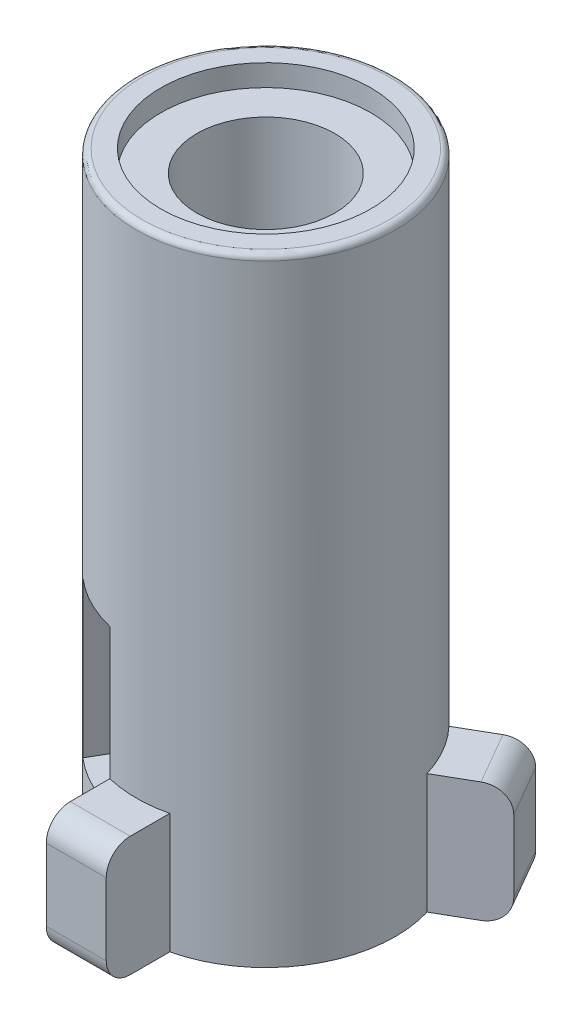
ISO-10303-21;
HEADER;
FILE_DESCRIPTION(('STEP AP214'),'2;1');
FILE_NAME('part.step','',(''),(''),'','','');
FILE_SCHEMA(('AUTOMOTIVE_DESIGN { 1 0 10303 214 1 1 1 1 }'));
ENDSEC;
DATA;
#1=APPLICATION_CONTEXT('core data for automotive mechanical design processes');
#2=APPLICATION_PROTOCOL_DEFINITION('international standard','automotive_design',2000,#1);
#3=PRODUCT_CONTEXT('',#1,'mechanical');
#4=PRODUCT('Part','Part','',(#3));
#5=PRODUCT_RELATED_PRODUCT_CATEGORY('part','',(#4));
#6=PRODUCT_DEFINITION_FORMATION('','',#4);
#7=PRODUCT_DEFINITION_CONTEXT('part definition',#1,'design');
#8=PRODUCT_DEFINITION('design','',#6,#7);
#9=PRODUCT_DEFINITION_SHAPE('','',#8);
#10=(LENGTH_UNIT() NAMED_UNIT(*) SI_UNIT(.MILLI.,.METRE.));
#11=(NAMED_UNIT(*) PLANE_ANGLE_UNIT() SI_UNIT($,.RADIAN.));
#12=(NAMED_UNIT(*) SI_UNIT($,.STERADIAN.) SOLID_ANGLE_UNIT());
#13=UNCERTAINTY_MEASURE_WITH_UNIT(LENGTH_MEASURE(1.E-05),#10,'distance_accuracy_value','');
#14=(GEOMETRIC_REPRESENTATION_CONTEXT(3) GLOBAL_UNCERTAINTY_ASSIGNED_CONTEXT((#13)) GLOBAL_UNIT_ASSIGNED_CONTEXT((#10,
#11,#12)) REPRESENTATION_CONTEXT('',''));
#15=CARTESIAN_POINT('',(0.,0.,0.));
#16=DIRECTION('',(0.,0.,1.));
#17=DIRECTION('',(1.,0.,0.));
#18=AXIS2_PLACEMENT_3D('',#15,#16,#17);
#19=CARTESIAN_POINT('',(0.,25.75,0.));
#20=DIRECTION('',(0.,-1.,0.));
#21=DIRECTION('',(0.,0.,-1.));
#22=AXIS2_PLACEMENT_3D('',#19,#20,#21);
#23=CYLINDRICAL_SURFACE('',#22,2.875);
#24=CARTESIAN_POINT('',(0.,24.85,0.));
#25=DIRECTION('',(0.,1.,0.));
#26=DIRECTION('',(0.,0.,1.));
#27=AXIS2_PLACEMENT_3D('',#24,#25,#26);
#28=CIRCLE('',#27,2.875);
#29=CARTESIAN_POINT('',(0.,24.85,2.875));
#30=VERTEX_POINT('',#29);
#31=EDGE_CURVE('E237',#30,#30,#28,.F.);
#32=ORIENTED_EDGE('',*,*,#31,.F.);
#33=EDGE_LOOP('',(#32));
#34=FACE_BOUND('',#33,.T.);
#35=CARTESIAN_POINT('',(0.,0.900000000000001,0.));
#36=DIRECTION('',(0.,-1.,0.));
#37=DIRECTION('',(0.,0.,-1.));
#38=AXIS2_PLACEMENT_3D('',#35,#36,#37);
#39=CIRCLE('',#38,2.875);
#40=CARTESIAN_POINT('',(0.,0.900000000000001,-2.875));
#41=VERTEX_POINT('',#40);
#42=EDGE_CURVE('E245',#41,#41,#39,.F.);
#43=ORIENTED_EDGE('',*,*,#42,.F.);
#44=EDGE_LOOP('',(#43));
#45=FACE_BOUND('',#44,.T.);
#46=DIRECTION('',(0.,-1.,0.));
#47=VECTOR('',#46,1.);
#48=CARTESIAN_POINT('',(0.124692696621201,25.75,2.87229468046183));
#49=LINE('',#48,#47);
#50=CARTESIAN_POINT('',(0.124692696621201,10.5,2.87229468046183));
#51=VERTEX_POINT('',#50);
#52=CARTESIAN_POINT('',(0.124692696621201,4.,2.87229468046183));
#53=VERTEX_POINT('',#52);
#54=EDGE_CURVE('E223',#51,#53,#49,.T.);
#55=ORIENTED_EDGE('',*,*,#54,.F.);
#56=CARTESIAN_POINT('',(0.,10.5,0.));
#57=DIRECTION('',(0.,-1.,0.));
#58=DIRECTION('',(0.,0.,-1.));
#59=AXIS2_PLACEMENT_3D('',#56,#57,#58);
#60=CIRCLE('',#59,2.875);
#61=CARTESIAN_POINT('',(-2.25145289354456,10.5,1.78789956880967));
#62=VERTEX_POINT('',#61);
#63=EDGE_CURVE('E229',#62,#51,#60,.F.);
#64=ORIENTED_EDGE('',*,*,#63,.F.);
#65=DIRECTION('',(0.,-1.,0.));
#66=VECTOR('',#65,1.);
#67=CARTESIAN_POINT('',(-2.25145289354457,25.75,1.78789956880967));
#68=LINE('',#67,#66);
#69=CARTESIAN_POINT('',(-2.25145289354457,4.,1.78789956880967));
#70=VERTEX_POINT('',#69);
#71=EDGE_CURVE('E226',#70,#62,#68,.F.);
#72=ORIENTED_EDGE('',*,*,#71,.F.);
#73=CARTESIAN_POINT('',(0.,4.,0.));
#74=DIRECTION('',(0.,1.,0.));
#75=DIRECTION('',(-1.,0.,0.));
#76=AXIS2_PLACEMENT_3D('',#73,#74,#75);
#77=CIRCLE('',#76,2.875);
#78=EDGE_CURVE('E201',#53,#70,#77,.F.);
#79=ORIENTED_EDGE('',*,*,#78,.F.);
#80=EDGE_LOOP('',(#55,#64,#72,#79));
#81=FACE_BOUND('',#80,.T.);
#82=ADVANCED_FACE('F39',(#34,#45,#81),#23,.F.);
#83=CARTESIAN_POINT('',(0.,25.75,0.));
#84=DIRECTION('',(0.,-1.,0.));
#85=DIRECTION('',(0.,0.,-1.));
#86=AXIS2_PLACEMENT_3D('',#83,#84,#85);
#87=CYLINDRICAL_SURFACE('',#86,5.4);
#88=CARTESIAN_POINT('',(0.,25.5,0.));
#89=DIRECTION('',(0.,1.,0.));
#90=DIRECTION('',(0.,0.,1.));
#91=AXIS2_PLACEMENT_3D('',#88,#89,#90);
#92=CIRCLE('',#91,5.4);
#93=CARTESIAN_POINT('',(0.,25.5,5.4));
#94=VERTEX_POINT('',#93);
#95=EDGE_CURVE('E196',#94,#94,#92,.F.);
#96=ORIENTED_EDGE('',*,*,#95,.T.);
#97=EDGE_LOOP('',(#96));
#98=FACE_BOUND('',#97,.T.);
#99=DIRECTION('',(0.,-1.,0.));
#100=VECTOR('',#99,1.);
#101=CARTESIAN_POINT('',(-1.25,25.75,5.25333227580362));
#102=LINE('',#101,#100);
#103=CARTESIAN_POINT('',(-1.25,5.,5.25333227580362));
#104=VERTEX_POINT('',#103);
#105=CARTESIAN_POINT('',(-1.25,10.5,5.25333227580362));
#106=VERTEX_POINT('',#105);
#107=EDGE_CURVE('E215',#104,#106,#102,.F.);
#108=ORIENTED_EDGE('',*,*,#107,.F.);
#109=CARTESIAN_POINT('',(0.,5.,0.));
#110=DIRECTION('',(0.,-1.,0.));
#111=DIRECTION('',(0.,0.,-1.));
#112=AXIS2_PLACEMENT_3D('',#109,#110,#111);
#113=CIRCLE('',#112,5.4);
#114=CARTESIAN_POINT('',(1.25,5.,5.25333227580362));
#115=VERTEX_POINT('',#114);
#116=EDGE_CURVE('E345',#115,#104,#113,.T.);
#117=ORIENTED_EDGE('',*,*,#116,.F.);
#118=DIRECTION('',(0.,-1.,0.));
#119=VECTOR('',#118,1.);
#120=CARTESIAN_POINT('',(1.25,25.75,5.25333227580362));
#121=LINE('',#120,#119);
#122=CARTESIAN_POINT('',(1.25,0.,5.25333227580362));
#123=VERTEX_POINT('',#122);
#124=EDGE_CURVE('E330',#115,#123,#121,.T.);
#125=ORIENTED_EDGE('',*,*,#124,.T.);
#126=CARTESIAN_POINT('',(0.,0.,0.));
#127=DIRECTION('',(0.,1.,0.));
#128=DIRECTION('',(0.,0.,1.));
#129=AXIS2_PLACEMENT_3D('',#126,#127,#128);
#130=CIRCLE('',#129,5.4);
#131=CARTESIAN_POINT('',(5.17451920536665,0.,-1.54413438317126));
#132=VERTEX_POINT('',#131);
#133=EDGE_CURVE('E341',#123,#132,#130,.T.);
#134=ORIENTED_EDGE('',*,*,#133,.T.);
#135=DIRECTION('',(0.,-1.,0.));
#136=VECTOR('',#135,1.);
#137=CARTESIAN_POINT('',(5.17451920536665,25.75,-1.54413438317126));
#138=LINE('',#137,#136);
#139=CARTESIAN_POINT('',(5.17451920536665,5.,-1.54413438317126));
#140=VERTEX_POINT('',#139);
#141=EDGE_CURVE('E306',#132,#140,#138,.F.);
#142=ORIENTED_EDGE('',*,*,#141,.T.);
#143=CARTESIAN_POINT('',(0.,5.,0.));
#144=DIRECTION('',(0.,1.,0.));
#145=DIRECTION('',(0.,0.,1.));
#146=AXIS2_PLACEMENT_3D('',#143,#144,#145);
#147=CIRCLE('',#146,5.4);
#148=CARTESIAN_POINT('',(3.92451920536665,5.,-3.70919789263236));
#149=VERTEX_POINT('',#148);
#150=EDGE_CURVE('E350',#140,#149,#147,.T.);
#151=ORIENTED_EDGE('',*,*,#150,.T.);
#152=DIRECTION('',(0.,-1.,0.));
#153=VECTOR('',#152,1.);
#154=CARTESIAN_POINT('',(3.92451920536665,25.75,-3.70919789263236));
#155=LINE('',#154,#153);
#156=CARTESIAN_POINT('',(3.92451920536665,0.,-3.70919789263236));
#157=VERTEX_POINT('',#156);
#158=EDGE_CURVE('E299',#149,#157,#155,.T.);
#159=ORIENTED_EDGE('',*,*,#158,.T.);
#160=CARTESIAN_POINT('',(-3.92451920536665,0.,-3.70919789263236));
#161=VERTEX_POINT('',#160);
#162=EDGE_CURVE('E346',#157,#161,#130,.T.);
#163=ORIENTED_EDGE('',*,*,#162,.T.);
#164=DIRECTION('',(0.,-1.,0.));
#165=VECTOR('',#164,1.);
#166=CARTESIAN_POINT('',(-3.92451920536665,25.75,-3.70919789263236));
#167=LINE('',#166,#165);
#168=CARTESIAN_POINT('',(-3.92451920536665,5.,-3.70919789263236));
#169=VERTEX_POINT('',#168);
#170=EDGE_CURVE('E269',#161,#169,#167,.F.);
#171=ORIENTED_EDGE('',*,*,#170,.T.);
#172=CARTESIAN_POINT('',(0.,5.,0.));
#173=DIRECTION('',(0.,1.,0.));
#174=DIRECTION('',(0.,0.,1.));
#175=AXIS2_PLACEMENT_3D('',#172,#173,#174);
#176=CIRCLE('',#175,5.4);
#177=CARTESIAN_POINT('',(-5.17451920536665,5.,-1.54413438317126));
#178=VERTEX_POINT('',#177);
#179=EDGE_CURVE('E353',#169,#178,#176,.T.);
#180=ORIENTED_EDGE('',*,*,#179,.T.);
#181=DIRECTION('',(0.,-1.,0.));
#182=VECTOR('',#181,1.);
#183=CARTESIAN_POINT('',(-5.17451920536665,25.75,-1.54413438317126));
#184=LINE('',#183,#182);
#185=CARTESIAN_POINT('',(-5.17451920536665,0.,-1.54413438317126));
#186=VERTEX_POINT('',#185);
#187=EDGE_CURVE('E276',#178,#186,#184,.T.);
#188=ORIENTED_EDGE('',*,*,#187,.T.);
#189=CARTESIAN_POINT('',(-1.25,0.,5.25333227580362));
#190=VERTEX_POINT('',#189);
#191=EDGE_CURVE('E340',#186,#190,#130,.T.);
#192=ORIENTED_EDGE('',*,*,#191,.T.);
#193=DIRECTION('',(0.,-1.,0.));
#194=VECTOR('',#193,1.);
#195=CARTESIAN_POINT('',(-1.25,25.75,5.25333227580362));
#196=LINE('',#195,#194);
#197=CARTESIAN_POINT('',(-1.25,4.,5.25333227580362));
#198=VERTEX_POINT('',#197);
#199=EDGE_CURVE('E209',#190,#198,#196,.F.);
#200=ORIENTED_EDGE('',*,*,#199,.T.);
#201=CARTESIAN_POINT('',(0.,4.,0.));
#202=DIRECTION('',(0.,1.,0.));
#203=DIRECTION('',(-1.,0.,0.));
#204=AXIS2_PLACEMENT_3D('',#201,#202,#203);
#205=CIRCLE('',#204,5.4);
#206=CARTESIAN_POINT('',(-3.56228993209276,4.,4.05833592001827));
#207=VERTEX_POINT('',#206);
#208=EDGE_CURVE('E198',#207,#198,#205,.T.);
#209=ORIENTED_EDGE('',*,*,#208,.F.);
#210=DIRECTION('',(0.,-1.,0.));
#211=VECTOR('',#210,1.);
#212=CARTESIAN_POINT('',(-3.56228993209276,25.75,4.05833592001827));
#213=LINE('',#212,#211);
#214=CARTESIAN_POINT('',(-3.56228993209276,10.5,4.05833592001827));
#215=VERTEX_POINT('',#214);
#216=EDGE_CURVE('E48',#215,#207,#213,.T.);
#217=ORIENTED_EDGE('',*,*,#216,.F.);
#218=CARTESIAN_POINT('',(0.,10.5,0.));
#219=DIRECTION('',(0.,-1.,0.));
#220=DIRECTION('',(0.,0.,-1.));
#221=AXIS2_PLACEMENT_3D('',#218,#219,#220);
#222=CIRCLE('',#221,5.4);
#223=EDGE_CURVE('E11',#106,#215,#222,.T.);
#224=ORIENTED_EDGE('',*,*,#223,.F.);
#225=EDGE_LOOP('',(#108,#117,#125,#134,#142,#151,#159,#163,#171,#180,#188,#192,#200,#209,#217,#224));
#226=FACE_BOUND('',#225,.T.);
#227=ADVANCED_FACE('F206',(#98,#226),#87,.T.);
#228=CARTESIAN_POINT('',(0.,25.75,0.));
#229=DIRECTION('',(0.,1.,0.));
#230=DIRECTION('',(0.,0.,1.));
#231=AXIS2_PLACEMENT_3D('',#228,#229,#230);
#232=PLANE('',#231);
#233=CARTESIAN_POINT('',(0.,25.75,0.));
#234=DIRECTION('',(0.,1.,0.));
#235=DIRECTION('',(0.,0.,1.));
#236=AXIS2_PLACEMENT_3D('',#233,#234,#235);
#237=CIRCLE('',#236,4.375);
#238=CARTESIAN_POINT('',(0.,25.75,4.375));
#239=VERTEX_POINT('',#238);
#240=EDGE_CURVE('E232',#239,#239,#237,.T.);
#241=ORIENTED_EDGE('',*,*,#240,.F.);
#242=EDGE_LOOP('',(#241));
#243=FACE_BOUND('',#242,.T.);
#244=CARTESIAN_POINT('',(0.,25.75,0.));
#245=DIRECTION('',(0.,1.,0.));
#246=DIRECTION('',(0.,0.,1.));
#247=AXIS2_PLACEMENT_3D('',#244,#245,#246);
#248=CIRCLE('',#247,5.15);
#249=CARTESIAN_POINT('',(0.,25.75,5.15));
#250=VERTEX_POINT('',#249);
#251=EDGE_CURVE('E434',#250,#250,#248,.T.);
#252=ORIENTED_EDGE('',*,*,#251,.T.);
#253=EDGE_LOOP('',(#252));
#254=FACE_BOUND('',#253,.T.);
#255=ADVANCED_FACE('F569',(#243,#254),#232,.T.);
#256=CARTESIAN_POINT('',(0.,0.,0.));
#257=DIRECTION('',(0.,1.,0.));
#258=DIRECTION('',(0.,0.,1.));
#259=AXIS2_PLACEMENT_3D('',#256,#257,#258);
#260=PLANE('',#259);
#261=CARTESIAN_POINT('',(0.,0.,0.));
#262=DIRECTION('',(0.,-1.,0.));
#263=DIRECTION('',(0.,0.,-1.));
#264=AXIS2_PLACEMENT_3D('',#261,#262,#263);
#265=CIRCLE('',#264,4.375);
#266=CARTESIAN_POINT('',(0.,0.,-4.375));
#267=VERTEX_POINT('',#266);
#268=EDGE_CURVE('E246',#267,#267,#265,.T.);
#269=ORIENTED_EDGE('',*,*,#268,.F.);
#270=EDGE_LOOP('',(#269));
#271=FACE_BOUND('',#270,.T.);
#272=DIRECTION('',(-0.866025403784438,0.,-0.5));
#273=VECTOR('',#272,1.);
#274=CARTESIAN_POINT('',(-7.46660068989707,0.,-2.86746824526945));
#275=LINE('',#274,#273);
#276=CARTESIAN_POINT('',(-6.60057528611263,0.,-2.36746824526945));
#277=VERTEX_POINT('',#276);
#278=EDGE_CURVE('E259',#186,#277,#275,.T.);
#279=ORIENTED_EDGE('',*,*,#278,.T.);
#280=DIRECTION('',(0.5,0.,-0.866025403784438));
#281=VECTOR('',#280,1.);
#282=CARTESIAN_POINT('',(-5.35057528611263,0.,-4.53253175473055));
#283=LINE('',#282,#281);
#284=CARTESIAN_POINT('',(-5.35057528611263,0.,-4.53253175473055));
#285=VERTEX_POINT('',#284);
#286=EDGE_CURVE('E364',#277,#285,#283,.T.);
#287=ORIENTED_EDGE('',*,*,#286,.T.);
#288=DIRECTION('',(0.866025403784438,0.,0.5));
#289=VECTOR('',#288,1.);
#290=CARTESIAN_POINT('',(-1.48810198523403,0.,-2.30253175473055));
#291=LINE('',#290,#289);
#292=EDGE_CURVE('E255',#285,#161,#291,.T.);
#293=ORIENTED_EDGE('',*,*,#292,.T.);
#294=ORIENTED_EDGE('',*,*,#162,.F.);
#295=DIRECTION('',(0.866025403784439,0.,-0.5));
#296=VECTOR('',#295,1.);
#297=CARTESIAN_POINT('',(6.21660068989707,0.,-5.03253175473055));
#298=LINE('',#297,#296);
#299=CARTESIAN_POINT('',(5.35057528611263,0.,-4.53253175473055));
#300=VERTEX_POINT('',#299);
#301=EDGE_CURVE('E280',#157,#300,#298,.T.);
#302=ORIENTED_EDGE('',*,*,#301,.T.);
#303=DIRECTION('',(0.5,0.,0.866025403784439));
#304=VECTOR('',#303,1.);
#305=CARTESIAN_POINT('',(6.60057528611263,0.,-2.36746824526945));
#306=LINE('',#305,#304);
#307=CARTESIAN_POINT('',(6.60057528611263,0.,-2.36746824526945));
#308=VERTEX_POINT('',#307);
#309=EDGE_CURVE('E356',#300,#308,#306,.T.);
#310=ORIENTED_EDGE('',*,*,#309,.T.);
#311=DIRECTION('',(-0.866025403784439,0.,0.5));
#312=VECTOR('',#311,1.);
#313=CARTESIAN_POINT('',(2.73810198523403,0.,-0.137468245269452));
#314=LINE('',#313,#312);
#315=EDGE_CURVE('E286',#308,#132,#314,.T.);
#316=ORIENTED_EDGE('',*,*,#315,.T.);
#317=ORIENTED_EDGE('',*,*,#133,.F.);
#318=DIRECTION('',(0.,0.,1.));
#319=VECTOR('',#318,1.);
#320=CARTESIAN_POINT('',(1.25,0.,7.9));
#321=LINE('',#320,#319);
#322=CARTESIAN_POINT('',(1.25,0.,6.9));
#323=VERTEX_POINT('',#322);
#324=EDGE_CURVE('E316',#123,#323,#321,.T.);
#325=ORIENTED_EDGE('',*,*,#324,.T.);
#326=DIRECTION('',(-1.,0.,0.));
#327=VECTOR('',#326,1.);
#328=CARTESIAN_POINT('',(-1.25,0.,6.9));
#329=LINE('',#328,#327);
#330=CARTESIAN_POINT('',(-1.25,0.,6.9));
#331=VERTEX_POINT('',#330);
#332=EDGE_CURVE('E360',#323,#331,#329,.T.);
#333=ORIENTED_EDGE('',*,*,#332,.T.);
#334=DIRECTION('',(0.,0.,-1.));
#335=VECTOR('',#334,1.);
#336=CARTESIAN_POINT('',(-1.25,0.,7.9));
#337=LINE('',#336,#335);
#338=EDGE_CURVE('E310',#331,#190,#337,.T.);
#339=ORIENTED_EDGE('',*,*,#338,.T.);
#340=ORIENTED_EDGE('',*,*,#191,.F.);
#341=EDGE_LOOP('',(#279,#287,#293,#294,#302,#310,#316,#317,#325,#333,#339,#340));
#342=FACE_BOUND('',#341,.T.);
#343=ADVANCED_FACE('F487',(#271,#342),#260,.F.);
#344=CARTESIAN_POINT('',(-1.25,5.,7.9));
#345=DIRECTION('',(-1.,0.,0.));
#346=DIRECTION('',(0.,0.,1.));
#347=AXIS2_PLACEMENT_3D('',#344,#345,#346);
#348=PLANE('',#347);
#349=ORIENTED_EDGE('',*,*,#338,.F.);
#350=CARTESIAN_POINT('',(-1.25,1.,6.9));
#351=DIRECTION('',(-1.,0.,0.));
#352=DIRECTION('',(0.,0.,1.));
#353=AXIS2_PLACEMENT_3D('',#350,#351,#352);
#354=CIRCLE('',#353,1.);
#355=CARTESIAN_POINT('',(-1.25,1.,7.9));
#356=VERTEX_POINT('',#355);
#357=EDGE_CURVE('E390',#331,#356,#354,.T.);
#358=ORIENTED_EDGE('',*,*,#357,.T.);
#359=DIRECTION('',(0.,-1.,0.));
#360=VECTOR('',#359,1.);
#361=CARTESIAN_POINT('',(-1.25,5.,7.9));
#362=LINE('',#361,#360);
#363=CARTESIAN_POINT('',(-1.25,4.,7.9));
#364=VERTEX_POINT('',#363);
#365=EDGE_CURVE('E326',#364,#356,#362,.T.);
#366=ORIENTED_EDGE('',*,*,#365,.F.);
#367=CARTESIAN_POINT('',(-1.25,4.,6.9));
#368=DIRECTION('',(-1.,0.,0.));
#369=DIRECTION('',(0.,0.,1.));
#370=AXIS2_PLACEMENT_3D('',#367,#368,#369);
#371=CIRCLE('',#370,1.);
#372=CARTESIAN_POINT('',(-1.25,5.,6.9));
#373=VERTEX_POINT('',#372);
#374=EDGE_CURVE('E387',#364,#373,#371,.T.);
#375=ORIENTED_EDGE('',*,*,#374,.T.);
#376=DIRECTION('',(0.,0.,-1.));
#377=VECTOR('',#376,1.);
#378=CARTESIAN_POINT('',(-1.25,5.,7.9));
#379=LINE('',#378,#377);
#380=EDGE_CURVE('E311',#373,#104,#379,.T.);
#381=ORIENTED_EDGE('',*,*,#380,.T.);
#382=EDGE_CURVE('E337',#198,#104,#196,.F.);
#383=ORIENTED_EDGE('',*,*,#382,.F.);
#384=ORIENTED_EDGE('',*,*,#199,.F.);
#385=EDGE_LOOP('',(#349,#358,#366,#375,#381,#383,#384));
#386=FACE_BOUND('',#385,.T.);
#387=ADVANCED_FACE('F465',(#386),#348,.T.);
#388=CARTESIAN_POINT('',(1.25,5.,7.9));
#389=DIRECTION('',(1.,0.,0.));
#390=DIRECTION('',(0.,0.,-1.));
#391=AXIS2_PLACEMENT_3D('',#388,#389,#390);
#392=PLANE('',#391);
#393=DIRECTION('',(0.,-1.,0.));
#394=VECTOR('',#393,1.);
#395=CARTESIAN_POINT('',(1.25,5.,7.9));
#396=LINE('',#395,#394);
#397=CARTESIAN_POINT('',(1.25,4.,7.9));
#398=VERTEX_POINT('',#397);
#399=CARTESIAN_POINT('',(1.25,1.,7.9));
#400=VERTEX_POINT('',#399);
#401=EDGE_CURVE('E320',#398,#400,#396,.T.);
#402=ORIENTED_EDGE('',*,*,#401,.T.);
#403=CARTESIAN_POINT('',(1.25,1.,6.9));
#404=DIRECTION('',(1.,0.,0.));
#405=DIRECTION('',(0.,0.,-1.));
#406=AXIS2_PLACEMENT_3D('',#403,#404,#405);
#407=CIRCLE('',#406,1.);
#408=EDGE_CURVE('E403',#400,#323,#407,.T.);
#409=ORIENTED_EDGE('',*,*,#408,.T.);
#410=ORIENTED_EDGE('',*,*,#324,.F.);
#411=ORIENTED_EDGE('',*,*,#124,.F.);
#412=DIRECTION('',(0.,0.,1.));
#413=VECTOR('',#412,1.);
#414=CARTESIAN_POINT('',(1.25,5.,7.9));
#415=LINE('',#414,#413);
#416=CARTESIAN_POINT('',(1.25,5.,6.9));
#417=VERTEX_POINT('',#416);
#418=EDGE_CURVE('E315',#115,#417,#415,.T.);
#419=ORIENTED_EDGE('',*,*,#418,.T.);
#420=CARTESIAN_POINT('',(1.25,4.,6.9));
#421=DIRECTION('',(1.,0.,0.));
#422=DIRECTION('',(0.,0.,-1.));
#423=AXIS2_PLACEMENT_3D('',#420,#421,#422);
#424=CIRCLE('',#423,1.);
#425=EDGE_CURVE('E400',#417,#398,#424,.T.);
#426=ORIENTED_EDGE('',*,*,#425,.T.);
#427=EDGE_LOOP('',(#402,#409,#410,#411,#419,#426));
#428=FACE_BOUND('',#427,.T.);
#429=ADVANCED_FACE('F473',(#428),#392,.T.);
#430=CARTESIAN_POINT('',(-1.25,5.,7.9));
#431=DIRECTION('',(0.,0.,1.));
#432=DIRECTION('',(1.,0.,0.));
#433=AXIS2_PLACEMENT_3D('',#430,#431,#432);
#434=PLANE('',#433);
#435=ORIENTED_EDGE('',*,*,#365,.T.);
#436=DIRECTION('',(-1.,0.,0.));
#437=VECTOR('',#436,1.);
#438=CARTESIAN_POINT('',(1.25,1.,7.9));
#439=LINE('',#438,#437);
#440=EDGE_CURVE('E397',#356,#400,#439,.F.);
#441=ORIENTED_EDGE('',*,*,#440,.T.);
#442=ORIENTED_EDGE('',*,*,#401,.F.);
#443=DIRECTION('',(-1.,0.,0.));
#444=VECTOR('',#443,1.);
#445=CARTESIAN_POINT('',(-1.25,4.,7.9));
#446=LINE('',#445,#444);
#447=EDGE_CURVE('E393',#398,#364,#446,.T.);
#448=ORIENTED_EDGE('',*,*,#447,.T.);
#449=EDGE_LOOP('',(#435,#441,#442,#448));
#450=FACE_BOUND('',#449,.T.);
#451=ADVANCED_FACE('F480',(#450),#434,.T.);
#452=CARTESIAN_POINT('',(0.,5.,0.));
#453=DIRECTION('',(0.,-1.,0.));
#454=DIRECTION('',(0.,0.,-1.));
#455=AXIS2_PLACEMENT_3D('',#452,#453,#454);
#456=PLANE('',#455);
#457=ORIENTED_EDGE('',*,*,#380,.F.);
#458=DIRECTION('',(-1.,0.,0.));
#459=VECTOR('',#458,1.);
#460=CARTESIAN_POINT('',(1.25,5.,6.9));
#461=LINE('',#460,#459);
#462=EDGE_CURVE('E431',#373,#417,#461,.F.);
#463=ORIENTED_EDGE('',*,*,#462,.T.);
#464=ORIENTED_EDGE('',*,*,#418,.F.);
#465=ORIENTED_EDGE('',*,*,#116,.T.);
#466=EDGE_LOOP('',(#457,#463,#464,#465));
#467=FACE_BOUND('',#466,.T.);
#468=ADVANCED_FACE('F470',(#467),#456,.F.);
#469=CARTESIAN_POINT('',(2.73810198523403,5.,-0.137468245269452));
#470=DIRECTION('',(0.5,0.,0.866025403784439));
#471=DIRECTION('',(0.866025403784439,0.,-0.5));
#472=AXIS2_PLACEMENT_3D('',#469,#470,#471);
#473=PLANE('',#472);
#474=ORIENTED_EDGE('',*,*,#315,.F.);
#475=CARTESIAN_POINT('',(6.60057528611263,1.,-2.36746824526945));
#476=DIRECTION('',(0.5,0.,0.866025403784439));
#477=DIRECTION('',(0.866025403784439,0.,-0.5));
#478=AXIS2_PLACEMENT_3D('',#475,#476,#477);
#479=CIRCLE('',#478,1.);
#480=CARTESIAN_POINT('',(7.46660068989707,1.,-2.86746824526945));
#481=VERTEX_POINT('',#480);
#482=EDGE_CURVE('E409',#308,#481,#479,.T.);
#483=ORIENTED_EDGE('',*,*,#482,.T.);
#484=DIRECTION('',(0.,-1.,0.));
#485=VECTOR('',#484,1.);
#486=CARTESIAN_POINT('',(7.46660068989707,5.,-2.86746824526945));
#487=LINE('',#486,#485);
#488=CARTESIAN_POINT('',(7.46660068989707,4.,-2.86746824526945));
#489=VERTEX_POINT('',#488);
#490=EDGE_CURVE('E295',#489,#481,#487,.T.);
#491=ORIENTED_EDGE('',*,*,#490,.F.);
#492=CARTESIAN_POINT('',(6.60057528611263,4.,-2.36746824526945));
#493=DIRECTION('',(0.5,0.,0.866025403784439));
#494=DIRECTION('',(0.866025403784439,0.,-0.5));
#495=AXIS2_PLACEMENT_3D('',#492,#493,#494);
#496=CIRCLE('',#495,1.);
#497=CARTESIAN_POINT('',(6.60057528611263,5.,-2.36746824526945));
#498=VERTEX_POINT('',#497);
#499=EDGE_CURVE('E406',#489,#498,#496,.T.);
#500=ORIENTED_EDGE('',*,*,#499,.T.);
#501=DIRECTION('',(-0.866025403784439,0.,0.5));
#502=VECTOR('',#501,1.);
#503=CARTESIAN_POINT('',(2.73810198523403,5.,-0.137468245269452));
#504=LINE('',#503,#502);
#505=EDGE_CURVE('E285',#498,#140,#504,.T.);
#506=ORIENTED_EDGE('',*,*,#505,.T.);
#507=ORIENTED_EDGE('',*,*,#141,.F.);
#508=EDGE_LOOP('',(#474,#483,#491,#500,#506,#507));
#509=FACE_BOUND('',#508,.T.);
#510=ADVANCED_FACE('F492',(#509),#473,.T.);
#511=CARTESIAN_POINT('',(6.21660068989707,5.,-5.03253175473055));
#512=DIRECTION('',(-0.5,0.,-0.866025403784439));
#513=DIRECTION('',(-0.866025403784439,0.,0.5));
#514=AXIS2_PLACEMENT_3D('',#511,#512,#513);
#515=PLANE('',#514);
#516=DIRECTION('',(0.,-1.,0.));
#517=VECTOR('',#516,1.);
#518=CARTESIAN_POINT('',(6.21660068989707,5.,-5.03253175473055));
#519=LINE('',#518,#517);
#520=CARTESIAN_POINT('',(6.21660068989707,4.,-5.03253175473055));
#521=VERTEX_POINT('',#520);
#522=CARTESIAN_POINT('',(6.21660068989707,1.,-5.03253175473055));
#523=VERTEX_POINT('',#522);
#524=EDGE_CURVE('E289',#521,#523,#519,.T.);
#525=ORIENTED_EDGE('',*,*,#524,.T.);
#526=CARTESIAN_POINT('',(5.35057528611263,1.,-4.53253175473055));
#527=DIRECTION('',(-0.5,0.,-0.866025403784439));
#528=DIRECTION('',(-0.866025403784439,0.,0.5));
#529=AXIS2_PLACEMENT_3D('',#526,#527,#528);
#530=CIRCLE('',#529,1.);
#531=EDGE_CURVE('E422',#523,#300,#530,.T.);
#532=ORIENTED_EDGE('',*,*,#531,.T.);
#533=ORIENTED_EDGE('',*,*,#301,.F.);
#534=ORIENTED_EDGE('',*,*,#158,.F.);
#535=DIRECTION('',(0.866025403784439,0.,-0.5));
#536=VECTOR('',#535,1.);
#537=CARTESIAN_POINT('',(6.21660068989707,5.,-5.03253175473055));
#538=LINE('',#537,#536);
#539=CARTESIAN_POINT('',(5.35057528611263,5.,-4.53253175473055));
#540=VERTEX_POINT('',#539);
#541=EDGE_CURVE('E281',#149,#540,#538,.T.);
#542=ORIENTED_EDGE('',*,*,#541,.T.);
#543=CARTESIAN_POINT('',(5.35057528611263,4.,-4.53253175473055));
#544=DIRECTION('',(-0.5,0.,-0.866025403784439));
#545=DIRECTION('',(-0.866025403784439,0.,0.5));
#546=AXIS2_PLACEMENT_3D('',#543,#544,#545);
#547=CIRCLE('',#546,1.);
#548=EDGE_CURVE('E419',#540,#521,#547,.T.);
#549=ORIENTED_EDGE('',*,*,#548,.T.);
#550=EDGE_LOOP('',(#525,#532,#533,#534,#542,#549));
#551=FACE_BOUND('',#550,.T.);
#552=ADVANCED_FACE('F505',(#551),#515,.T.);
#553=CARTESIAN_POINT('',(7.46660068989707,5.,-2.86746824526945));
#554=DIRECTION('',(0.866025403784439,0.,-0.5));
#555=DIRECTION('',(-0.5,0.,-0.866025403784439));
#556=AXIS2_PLACEMENT_3D('',#553,#554,#555);
#557=PLANE('',#556);
#558=ORIENTED_EDGE('',*,*,#490,.T.);
#559=DIRECTION('',(0.5,0.,0.866025403784439));
#560=VECTOR('',#559,1.);
#561=CARTESIAN_POINT('',(6.21660068989707,1.,-5.03253175473055));
#562=LINE('',#561,#560);
#563=EDGE_CURVE('E416',#481,#523,#562,.F.);
#564=ORIENTED_EDGE('',*,*,#563,.T.);
#565=ORIENTED_EDGE('',*,*,#524,.F.);
#566=DIRECTION('',(0.5,0.,0.866025403784439));
#567=VECTOR('',#566,1.);
#568=CARTESIAN_POINT('',(7.46660068989707,4.,-2.86746824526945));
#569=LINE('',#568,#567);
#570=EDGE_CURVE('E412',#521,#489,#569,.T.);
#571=ORIENTED_EDGE('',*,*,#570,.T.);
#572=EDGE_LOOP('',(#558,#564,#565,#571));
#573=FACE_BOUND('',#572,.T.);
#574=ADVANCED_FACE('F509',(#573),#557,.T.);
#575=CARTESIAN_POINT('',(0.,5.,0.));
#576=DIRECTION('',(0.,1.,0.));
#577=DIRECTION('',(0.,0.,1.));
#578=AXIS2_PLACEMENT_3D('',#575,#576,#577);
#579=PLANE('',#578);
#580=ORIENTED_EDGE('',*,*,#505,.F.);
#581=DIRECTION('',(0.5,0.,0.866025403784439));
#582=VECTOR('',#581,1.);
#583=CARTESIAN_POINT('',(5.97557528611263,5.,-3.45));
#584=LINE('',#583,#582);
#585=EDGE_CURVE('E425',#498,#540,#584,.F.);
#586=ORIENTED_EDGE('',*,*,#585,.T.);
#587=ORIENTED_EDGE('',*,*,#541,.F.);
#588=ORIENTED_EDGE('',*,*,#150,.F.);
#589=EDGE_LOOP('',(#580,#586,#587,#588));
#590=FACE_BOUND('',#589,.T.);
#591=ADVANCED_FACE('F497',(#590),#579,.T.);
#592=CARTESIAN_POINT('',(-7.46660068989707,5.,-2.86746824526945));
#593=DIRECTION('',(-0.5,0.,0.866025403784439));
#594=DIRECTION('',(0.866025403784439,0.,0.5));
#595=AXIS2_PLACEMENT_3D('',#592,#593,#594);
#596=PLANE('',#595);
#597=DIRECTION('',(0.,-1.,0.));
#598=VECTOR('',#597,1.);
#599=CARTESIAN_POINT('',(-7.46660068989707,5.,-2.86746824526945));
#600=LINE('',#599,#598);
#601=CARTESIAN_POINT('',(-7.46660068989707,4.,-2.86746824526945));
#602=VERTEX_POINT('',#601);
#603=CARTESIAN_POINT('',(-7.46660068989707,1.,-2.86746824526945));
#604=VERTEX_POINT('',#603);
#605=EDGE_CURVE('E258',#602,#604,#600,.T.);
#606=ORIENTED_EDGE('',*,*,#605,.T.);
#607=CARTESIAN_POINT('',(-6.60057528611263,1.,-2.36746824526945));
#608=DIRECTION('',(-0.5,0.,0.866025403784439));
#609=DIRECTION('',(0.866025403784439,0.,0.5));
#610=AXIS2_PLACEMENT_3D('',#607,#608,#609);
#611=CIRCLE('',#610,1.);
#612=EDGE_CURVE('E384',#604,#277,#611,.T.);
#613=ORIENTED_EDGE('',*,*,#612,.T.);
#614=ORIENTED_EDGE('',*,*,#278,.F.);
#615=ORIENTED_EDGE('',*,*,#187,.F.);
#616=DIRECTION('',(-0.866025403784438,0.,-0.5));
#617=VECTOR('',#616,1.);
#618=CARTESIAN_POINT('',(-7.46660068989707,5.,-2.86746824526945));
#619=LINE('',#618,#617);
#620=CARTESIAN_POINT('',(-6.60057528611263,5.,-2.36746824526945));
#621=VERTEX_POINT('',#620);
#622=EDGE_CURVE('E250',#178,#621,#619,.T.);
#623=ORIENTED_EDGE('',*,*,#622,.T.);
#624=CARTESIAN_POINT('',(-6.60057528611263,4.,-2.36746824526945));
#625=DIRECTION('',(-0.5,0.,0.866025403784439));
#626=DIRECTION('',(0.866025403784439,0.,0.5));
#627=AXIS2_PLACEMENT_3D('',#624,#625,#626);
#628=CIRCLE('',#627,1.);
#629=EDGE_CURVE('E381',#621,#602,#628,.T.);
#630=ORIENTED_EDGE('',*,*,#629,.T.);
#631=EDGE_LOOP('',(#606,#613,#614,#615,#623,#630));
#632=FACE_BOUND('',#631,.T.);
#633=ADVANCED_FACE('F544',(#632),#596,.T.);
#634=CARTESIAN_POINT('',(-1.48810198523403,5.,-2.30253175473055));
#635=DIRECTION('',(0.5,0.,-0.866025403784438));
#636=DIRECTION('',(-0.866025403784439,0.,-0.5));
#637=AXIS2_PLACEMENT_3D('',#634,#635,#636);
#638=PLANE('',#637);
#639=ORIENTED_EDGE('',*,*,#292,.F.);
#640=CARTESIAN_POINT('',(-5.35057528611263,1.,-4.53253175473055));
#641=DIRECTION('',(0.5,0.,-0.866025403784438));
#642=DIRECTION('',(-0.866025403784439,0.,-0.5));
#643=AXIS2_PLACEMENT_3D('',#640,#641,#642);
#644=CIRCLE('',#643,1.);
#645=CARTESIAN_POINT('',(-6.21660068989706,1.,-5.03253175473055));
#646=VERTEX_POINT('',#645);
#647=EDGE_CURVE('E371',#285,#646,#644,.T.);
#648=ORIENTED_EDGE('',*,*,#647,.T.);
#649=DIRECTION('',(0.,-1.,0.));
#650=VECTOR('',#649,1.);
#651=CARTESIAN_POINT('',(-6.21660068989706,5.,-5.03253175473055));
#652=LINE('',#651,#650);
#653=CARTESIAN_POINT('',(-6.21660068989706,4.,-5.03253175473055));
#654=VERTEX_POINT('',#653);
#655=EDGE_CURVE('E265',#654,#646,#652,.T.);
#656=ORIENTED_EDGE('',*,*,#655,.F.);
#657=CARTESIAN_POINT('',(-5.35057528611263,4.,-4.53253175473055));
#658=DIRECTION('',(0.5,0.,-0.866025403784438));
#659=DIRECTION('',(-0.866025403784439,0.,-0.5));
#660=AXIS2_PLACEMENT_3D('',#657,#658,#659);
#661=CIRCLE('',#660,1.);
#662=CARTESIAN_POINT('',(-5.35057528611263,5.,-4.53253175473055));
#663=VERTEX_POINT('',#662);
#664=EDGE_CURVE('E368',#654,#663,#661,.T.);
#665=ORIENTED_EDGE('',*,*,#664,.T.);
#666=DIRECTION('',(0.866025403784438,0.,0.5));
#667=VECTOR('',#666,1.);
#668=CARTESIAN_POINT('',(-1.48810198523403,5.,-2.30253175473055));
#669=LINE('',#668,#667);
#670=EDGE_CURVE('E254',#663,#169,#669,.T.);
#671=ORIENTED_EDGE('',*,*,#670,.T.);
#672=ORIENTED_EDGE('',*,*,#170,.F.);
#673=EDGE_LOOP('',(#639,#648,#656,#665,#671,#672));
#674=FACE_BOUND('',#673,.T.);
#675=ADVANCED_FACE('F530',(#674),#638,.T.);
#676=CARTESIAN_POINT('',(-6.21660068989706,5.,-5.03253175473055));
#677=DIRECTION('',(-0.866025403784438,0.,-0.5));
#678=DIRECTION('',(-0.5,0.,0.866025403784438));
#679=AXIS2_PLACEMENT_3D('',#676,#677,#678);
#680=PLANE('',#679);
#681=ORIENTED_EDGE('',*,*,#655,.T.);
#682=DIRECTION('',(0.5,0.,-0.866025403784438));
#683=VECTOR('',#682,1.);
#684=CARTESIAN_POINT('',(-7.46660068989707,1.,-2.86746824526945));
#685=LINE('',#684,#683);
#686=EDGE_CURVE('E378',#646,#604,#685,.F.);
#687=ORIENTED_EDGE('',*,*,#686,.T.);
#688=ORIENTED_EDGE('',*,*,#605,.F.);
#689=DIRECTION('',(0.5,0.,-0.866025403784438));
#690=VECTOR('',#689,1.);
#691=CARTESIAN_POINT('',(-6.21660068989706,4.,-5.03253175473055));
#692=LINE('',#691,#690);
#693=EDGE_CURVE('E374',#602,#654,#692,.T.);
#694=ORIENTED_EDGE('',*,*,#693,.T.);
#695=EDGE_LOOP('',(#681,#687,#688,#694));
#696=FACE_BOUND('',#695,.T.);
#697=ADVANCED_FACE('F532',(#696),#680,.T.);
#698=CARTESIAN_POINT('',(0.,5.,0.));
#699=DIRECTION('',(0.,1.,0.));
#700=DIRECTION('',(0.,0.,1.));
#701=AXIS2_PLACEMENT_3D('',#698,#699,#700);
#702=PLANE('',#701);
#703=ORIENTED_EDGE('',*,*,#670,.F.);
#704=DIRECTION('',(0.5,0.,-0.866025403784438));
#705=VECTOR('',#704,1.);
#706=CARTESIAN_POINT('',(-5.97557528611263,5.,-3.45));
#707=LINE('',#706,#705);
#708=EDGE_CURVE('E428',#663,#621,#707,.F.);
#709=ORIENTED_EDGE('',*,*,#708,.T.);
#710=ORIENTED_EDGE('',*,*,#622,.F.);
#711=ORIENTED_EDGE('',*,*,#179,.F.);
#712=EDGE_LOOP('',(#703,#709,#710,#711));
#713=FACE_BOUND('',#712,.T.);
#714=ADVANCED_FACE('F542',(#713),#702,.T.);
#715=CARTESIAN_POINT('',(-5.97557528611263,1.,-3.45));
#716=DIRECTION('',(-0.5,0.,0.866025403784438));
#717=DIRECTION('',(0.866025403784438,0.,0.5));
#718=AXIS2_PLACEMENT_3D('',#715,#716,#717);
#719=CYLINDRICAL_SURFACE('',#718,1.);
#720=ORIENTED_EDGE('',*,*,#612,.F.);
#721=ORIENTED_EDGE('',*,*,#686,.F.);
#722=ORIENTED_EDGE('',*,*,#647,.F.);
#723=ORIENTED_EDGE('',*,*,#286,.F.);
#724=EDGE_LOOP('',(#720,#721,#722,#723));
#725=FACE_BOUND('',#724,.T.);
#726=ADVANCED_FACE('F526',(#725),#719,.T.);
#727=CARTESIAN_POINT('',(0.,1.,6.9));
#728=DIRECTION('',(1.,0.,0.));
#729=DIRECTION('',(0.,0.,-1.));
#730=AXIS2_PLACEMENT_3D('',#727,#728,#729);
#731=CYLINDRICAL_SURFACE('',#730,1.);
#732=ORIENTED_EDGE('',*,*,#408,.F.);
#733=ORIENTED_EDGE('',*,*,#440,.F.);
#734=ORIENTED_EDGE('',*,*,#357,.F.);
#735=ORIENTED_EDGE('',*,*,#332,.F.);
#736=EDGE_LOOP('',(#732,#733,#734,#735));
#737=FACE_BOUND('',#736,.T.);
#738=ADVANCED_FACE('F485',(#737),#731,.T.);
#739=CARTESIAN_POINT('',(5.97557528611263,1.,-3.45));
#740=DIRECTION('',(-0.5,0.,-0.866025403784439));
#741=DIRECTION('',(-0.866025403784439,0.,0.5));
#742=AXIS2_PLACEMENT_3D('',#739,#740,#741);
#743=CYLINDRICAL_SURFACE('',#742,1.);
#744=ORIENTED_EDGE('',*,*,#531,.F.);
#745=ORIENTED_EDGE('',*,*,#563,.F.);
#746=ORIENTED_EDGE('',*,*,#482,.F.);
#747=ORIENTED_EDGE('',*,*,#309,.F.);
#748=EDGE_LOOP('',(#744,#745,#746,#747));
#749=FACE_BOUND('',#748,.T.);
#750=ADVANCED_FACE('F512',(#749),#743,.T.);
#751=CARTESIAN_POINT('',(6.60057528611263,4.,-2.36746824526945));
#752=DIRECTION('',(0.5,0.,0.866025403784439));
#753=DIRECTION('',(0.866025403784439,0.,-0.5));
#754=AXIS2_PLACEMENT_3D('',#751,#752,#753);
#755=CYLINDRICAL_SURFACE('',#754,1.);
#756=ORIENTED_EDGE('',*,*,#548,.F.);
#757=ORIENTED_EDGE('',*,*,#585,.F.);
#758=ORIENTED_EDGE('',*,*,#499,.F.);
#759=ORIENTED_EDGE('',*,*,#570,.F.);
#760=EDGE_LOOP('',(#756,#757,#758,#759));
#761=FACE_BOUND('',#760,.T.);
#762=ADVANCED_FACE('F501',(#761),#755,.T.);
#763=CARTESIAN_POINT('',(-5.35057528611263,4.,-4.53253175473055));
#764=DIRECTION('',(0.5,0.,-0.866025403784438));
#765=DIRECTION('',(-0.866025403784438,0.,-0.5));
#766=AXIS2_PLACEMENT_3D('',#763,#764,#765);
#767=CYLINDRICAL_SURFACE('',#766,1.);
#768=ORIENTED_EDGE('',*,*,#629,.F.);
#769=ORIENTED_EDGE('',*,*,#708,.F.);
#770=ORIENTED_EDGE('',*,*,#664,.F.);
#771=ORIENTED_EDGE('',*,*,#693,.F.);
#772=EDGE_LOOP('',(#768,#769,#770,#771));
#773=FACE_BOUND('',#772,.T.);
#774=ADVANCED_FACE('F537',(#773),#767,.T.);
#775=CARTESIAN_POINT('',(-1.25,4.,6.9));
#776=DIRECTION('',(1.,0.,0.));
#777=DIRECTION('',(0.,0.,-1.));
#778=AXIS2_PLACEMENT_3D('',#775,#776,#777);
#779=CYLINDRICAL_SURFACE('',#778,1.);
#780=ORIENTED_EDGE('',*,*,#425,.F.);
#781=ORIENTED_EDGE('',*,*,#462,.F.);
#782=ORIENTED_EDGE('',*,*,#374,.F.);
#783=ORIENTED_EDGE('',*,*,#447,.F.);
#784=EDGE_LOOP('',(#780,#781,#782,#783));
#785=FACE_BOUND('',#784,.T.);
#786=ADVANCED_FACE('F478',(#785),#779,.T.);
#787=CARTESIAN_POINT('',(0.,25.5,0.));
#788=DIRECTION('',(0.,1.,0.));
#789=DIRECTION('',(0.,0.,1.));
#790=AXIS2_PLACEMENT_3D('',#787,#788,#789);
#791=TOROIDAL_SURFACE('',#790,5.15,0.25);
#792=ORIENTED_EDGE('',*,*,#95,.F.);
#793=EDGE_LOOP('',(#792));
#794=FACE_BOUND('',#793,.T.);
#795=ORIENTED_EDGE('',*,*,#251,.F.);
#796=EDGE_LOOP('',(#795));
#797=FACE_BOUND('',#796,.T.);
#798=ADVANCED_FACE('F41',(#794,#797),#791,.T.);
#799=CARTESIAN_POINT('',(0.,0.9,0.));
#800=DIRECTION('',(0.,-1.,0.));
#801=DIRECTION('',(0.,0.,-1.));
#802=AXIS2_PLACEMENT_3D('',#799,#800,#801);
#803=PLANE('',#802);
#804=CARTESIAN_POINT('',(0.,0.9,0.));
#805=DIRECTION('',(0.,-1.,0.));
#806=DIRECTION('',(0.,0.,-1.));
#807=AXIS2_PLACEMENT_3D('',#804,#805,#806);
#808=CIRCLE('',#807,4.375);
#809=CARTESIAN_POINT('',(0.,0.9,-4.375));
#810=VERTEX_POINT('',#809);
#811=EDGE_CURVE('E241',#810,#810,#808,.T.);
#812=ORIENTED_EDGE('',*,*,#811,.T.);
#813=EDGE_LOOP('',(#812));
#814=FACE_BOUND('',#813,.T.);
#815=ORIENTED_EDGE('',*,*,#42,.T.);
#816=EDGE_LOOP('',(#815));
#817=FACE_BOUND('',#816,.T.);
#818=ADVANCED_FACE('F592',(#814,#817),#803,.T.);
#819=CARTESIAN_POINT('',(0.,0.9,0.));
#820=DIRECTION('',(0.,-1.,0.));
#821=DIRECTION('',(0.,0.,-1.));
#822=AXIS2_PLACEMENT_3D('',#819,#820,#821);
#823=CYLINDRICAL_SURFACE('',#822,4.375);
#824=ORIENTED_EDGE('',*,*,#811,.F.);
#825=EDGE_LOOP('',(#824));
#826=FACE_BOUND('',#825,.T.);
#827=ORIENTED_EDGE('',*,*,#268,.T.);
#828=EDGE_LOOP('',(#827));
#829=FACE_BOUND('',#828,.T.);
#830=ADVANCED_FACE('F597',(#826,#829),#823,.F.);
#831=CARTESIAN_POINT('',(0.,24.85,0.));
#832=DIRECTION('',(0.,1.,0.));
#833=DIRECTION('',(0.,0.,1.));
#834=AXIS2_PLACEMENT_3D('',#831,#832,#833);
#835=PLANE('',#834);
#836=CARTESIAN_POINT('',(0.,24.85,0.));
#837=DIRECTION('',(0.,1.,0.));
#838=DIRECTION('',(0.,0.,1.));
#839=AXIS2_PLACEMENT_3D('',#836,#837,#838);
#840=CIRCLE('',#839,4.375);
#841=CARTESIAN_POINT('',(0.,24.85,4.375));
#842=VERTEX_POINT('',#841);
#843=EDGE_CURVE('E233',#842,#842,#840,.T.);
#844=ORIENTED_EDGE('',*,*,#843,.T.);
#845=EDGE_LOOP('',(#844));
#846=FACE_BOUND('',#845,.T.);
#847=ORIENTED_EDGE('',*,*,#31,.T.);
#848=EDGE_LOOP('',(#847));
#849=FACE_BOUND('',#848,.T.);
#850=ADVANCED_FACE('F448',(#846,#849),#835,.T.);
#851=CARTESIAN_POINT('',(0.,24.85,0.));
#852=DIRECTION('',(0.,1.,0.));
#853=DIRECTION('',(0.,0.,1.));
#854=AXIS2_PLACEMENT_3D('',#851,#852,#853);
#855=CYLINDRICAL_SURFACE('',#854,4.375);
#856=ORIENTED_EDGE('',*,*,#843,.F.);
#857=EDGE_LOOP('',(#856));
#858=FACE_BOUND('',#857,.T.);
#859=ORIENTED_EDGE('',*,*,#240,.T.);
#860=EDGE_LOOP('',(#859));
#861=FACE_BOUND('',#860,.T.);
#862=ADVANCED_FACE('F611',(#858,#861),#855,.F.);
#863=CARTESIAN_POINT('',(-3.66274039731668,10.5,9.43232122943002));
#864=DIRECTION('',(0.,-1.,0.));
#865=DIRECTION('',(0.,0.,-1.));
#866=AXIS2_PLACEMENT_3D('',#863,#864,#865);
#867=PLANE('',#866);
#868=ORIENTED_EDGE('',*,*,#63,.T.);
#869=DIRECTION('',(0.5,0.,-0.866025403784438));
#870=VECTOR('',#869,1.);
#871=CARTESIAN_POINT('',(-3.66274039731668,10.5,9.43232122943002));
#872=LINE('',#871,#870);
#873=EDGE_CURVE('E211',#106,#51,#872,.T.);
#874=ORIENTED_EDGE('',*,*,#873,.F.);
#875=ORIENTED_EDGE('',*,*,#223,.T.);
#876=DIRECTION('',(0.5,0.,-0.866025403784438));
#877=VECTOR('',#876,1.);
#878=CARTESIAN_POINT('',(-5.91440644715622,10.5,8.13232122943002));
#879=LINE('',#878,#877);
#880=EDGE_CURVE('E191',#215,#62,#879,.T.);
#881=ORIENTED_EDGE('',*,*,#880,.T.);
#882=EDGE_LOOP('',(#868,#874,#875,#881));
#883=FACE_BOUND('',#882,.T.);
#884=ADVANCED_FACE('F460',(#883),#867,.T.);
#885=CARTESIAN_POINT('',(-5.91440644715622,4.,8.13232122943002));
#886=DIRECTION('',(0.866025403784438,0.,0.5));
#887=DIRECTION('',(0.5,0.,-0.866025403784438));
#888=AXIS2_PLACEMENT_3D('',#885,#886,#887);
#889=PLANE('',#888);
#890=ORIENTED_EDGE('',*,*,#71,.T.);
#891=ORIENTED_EDGE('',*,*,#880,.F.);
#892=ORIENTED_EDGE('',*,*,#216,.T.);
#893=DIRECTION('',(0.5,0.,-0.866025403784438));
#894=VECTOR('',#893,1.);
#895=CARTESIAN_POINT('',(-5.91440644715622,4.,8.13232122943002));
#896=LINE('',#895,#894);
#897=EDGE_CURVE('E188',#207,#70,#896,.T.);
#898=ORIENTED_EDGE('',*,*,#897,.T.);
#899=EDGE_LOOP('',(#890,#891,#892,#898));
#900=FACE_BOUND('',#899,.T.);
#901=ADVANCED_FACE('F187',(#900),#889,.T.);
#902=CARTESIAN_POINT('',(-3.66274039731668,4.,9.43232122943002));
#903=DIRECTION('',(-0.866025403784438,0.,-0.5));
#904=DIRECTION('',(-0.5,0.,0.866025403784438));
#905=AXIS2_PLACEMENT_3D('',#902,#903,#904);
#906=PLANE('',#905);
#907=ORIENTED_EDGE('',*,*,#54,.T.);
#908=DIRECTION('',(0.5,0.,-0.866025403784438));
#909=VECTOR('',#908,1.);
#910=CARTESIAN_POINT('',(-3.66274039731668,4.,9.43232122943002));
#911=LINE('',#910,#909);
#912=EDGE_CURVE('E55',#198,#53,#911,.T.);
#913=ORIENTED_EDGE('',*,*,#912,.F.);
#914=ORIENTED_EDGE('',*,*,#382,.T.);
#915=ORIENTED_EDGE('',*,*,#107,.T.);
#916=ORIENTED_EDGE('',*,*,#873,.T.);
#917=EDGE_LOOP('',(#907,#913,#914,#915,#916));
#918=FACE_BOUND('',#917,.T.);
#919=ADVANCED_FACE('F457',(#918),#906,.T.);
#920=CARTESIAN_POINT('',(-3.66274039731668,4.,9.43232122943002));
#921=DIRECTION('',(0.,1.,0.));
#922=DIRECTION('',(-1.,0.,0.));
#923=AXIS2_PLACEMENT_3D('',#920,#921,#922);
#924=PLANE('',#923);
#925=ORIENTED_EDGE('',*,*,#78,.T.);
#926=ORIENTED_EDGE('',*,*,#897,.F.);
#927=ORIENTED_EDGE('',*,*,#208,.T.);
#928=ORIENTED_EDGE('',*,*,#912,.T.);
#929=EDGE_LOOP('',(#925,#926,#927,#928));
#930=FACE_BOUND('',#929,.T.);
#931=ADVANCED_FACE('F197',(#930),#924,.T.);
#932=CLOSED_SHELL('',(#82,#227,#255,#343,#387,#429,#451,#468,#510,#552,#574,#591,#633,#675,#697,
#714,#726,#738,#750,#762,#774,#786,#798,#818,#830,#850,#862,#884,#901,#919,#931));
#933=MANIFOLD_SOLID_BREP('B2',#932);
#934=ADVANCED_BREP_SHAPE_REPRESENTATION('',(#18,#933),#14);
#935=SHAPE_DEFINITION_REPRESENTATION(#9,#934);
ENDSEC;
END-ISO-10303-21;
